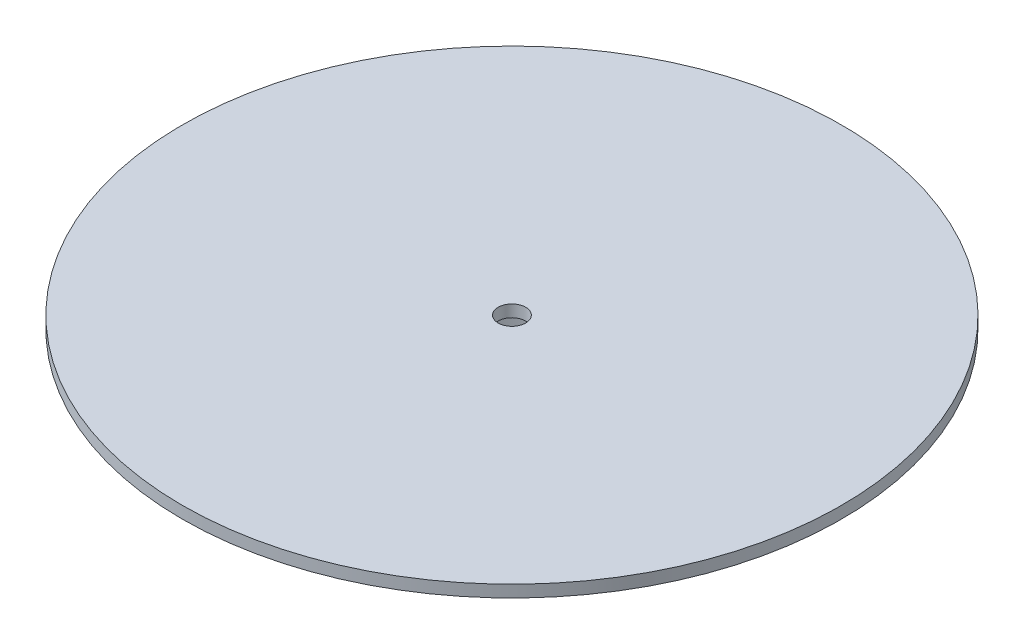
ISO-10303-21;
HEADER;
FILE_DESCRIPTION(('STEP AP214'),'2;1');
FILE_NAME('part.step','',(''),(''),'','','');
FILE_SCHEMA(('AUTOMOTIVE_DESIGN { 1 0 10303 214 1 1 1 1 }'));
ENDSEC;
DATA;
#1=APPLICATION_CONTEXT('core data for automotive mechanical design processes');
#2=APPLICATION_PROTOCOL_DEFINITION('international standard','automotive_design',2000,#1);
#3=PRODUCT_CONTEXT('',#1,'mechanical');
#4=PRODUCT('Part','Part','',(#3));
#5=PRODUCT_RELATED_PRODUCT_CATEGORY('part','',(#4));
#6=PRODUCT_DEFINITION_FORMATION('','',#4);
#7=PRODUCT_DEFINITION_CONTEXT('part definition',#1,'design');
#8=PRODUCT_DEFINITION('design','',#6,#7);
#9=PRODUCT_DEFINITION_SHAPE('','',#8);
#10=(LENGTH_UNIT() NAMED_UNIT(*) SI_UNIT(.MILLI.,.METRE.));
#11=(NAMED_UNIT(*) PLANE_ANGLE_UNIT() SI_UNIT($,.RADIAN.));
#12=(NAMED_UNIT(*) SI_UNIT($,.STERADIAN.) SOLID_ANGLE_UNIT());
#13=UNCERTAINTY_MEASURE_WITH_UNIT(LENGTH_MEASURE(1.E-05),#10,'distance_accuracy_value','');
#14=(GEOMETRIC_REPRESENTATION_CONTEXT(3) GLOBAL_UNCERTAINTY_ASSIGNED_CONTEXT((#13)) GLOBAL_UNIT_ASSIGNED_CONTEXT((#10,
#11,#12)) REPRESENTATION_CONTEXT('',''));
#15=CARTESIAN_POINT('',(0.,0.,0.));
#16=DIRECTION('',(0.,0.,1.));
#17=DIRECTION('',(1.,0.,0.));
#18=AXIS2_PLACEMENT_3D('',#15,#16,#17);
#19=CARTESIAN_POINT('',(0.,2.76606,0.));
#20=DIRECTION('',(0.,-1.,0.));
#21=DIRECTION('',(0.,0.,-1.));
#22=AXIS2_PLACEMENT_3D('',#19,#20,#21);
#23=CYLINDRICAL_SURFACE('',#22,76.2);
#24=CARTESIAN_POINT('',(0.,2.76606,0.));
#25=DIRECTION('',(0.,1.,0.));
#26=DIRECTION('',(0.,0.,1.));
#27=AXIS2_PLACEMENT_3D('',#24,#25,#26);
#28=CIRCLE('',#27,76.2);
#29=CARTESIAN_POINT('',(0.,2.76606,76.2));
#30=VERTEX_POINT('',#29);
#31=EDGE_CURVE('E39',#30,#30,#28,.T.);
#32=ORIENTED_EDGE('',*,*,#31,.F.);
#33=EDGE_LOOP('',(#32));
#34=FACE_BOUND('',#33,.T.);
#35=CARTESIAN_POINT('',(0.,0.,0.));
#36=DIRECTION('',(0.,1.,0.));
#37=DIRECTION('',(0.,0.,1.));
#38=AXIS2_PLACEMENT_3D('',#35,#36,#37);
#39=CIRCLE('',#38,76.2);
#40=CARTESIAN_POINT('',(0.,0.,76.2));
#41=VERTEX_POINT('',#40);
#42=EDGE_CURVE('E43',#41,#41,#39,.T.);
#43=ORIENTED_EDGE('',*,*,#42,.T.);
#44=EDGE_LOOP('',(#43));
#45=FACE_BOUND('',#44,.T.);
#46=ADVANCED_FACE('F33',(#34,#45),#23,.T.);
#47=CARTESIAN_POINT('',(0.,2.76606,0.));
#48=DIRECTION('',(0.,1.,0.));
#49=DIRECTION('',(0.,0.,1.));
#50=AXIS2_PLACEMENT_3D('',#47,#48,#49);
#51=PLANE('',#50);
#52=CARTESIAN_POINT('',(0.,2.76606,0.));
#53=DIRECTION('',(0.,-1.,0.));
#54=DIRECTION('',(0.,0.,-1.));
#55=AXIS2_PLACEMENT_3D('',#52,#53,#54);
#56=CIRCLE('',#55,3.175);
#57=CARTESIAN_POINT('',(0.,2.76606,-3.175));
#58=VERTEX_POINT('',#57);
#59=EDGE_CURVE('E56',#58,#58,#56,.T.);
#60=ORIENTED_EDGE('',*,*,#59,.T.);
#61=EDGE_LOOP('',(#60));
#62=FACE_BOUND('',#61,.T.);
#63=ORIENTED_EDGE('',*,*,#31,.T.);
#64=EDGE_LOOP('',(#63));
#65=FACE_BOUND('',#64,.T.);
#66=ADVANCED_FACE('F65',(#62,#65),#51,.T.);
#67=CARTESIAN_POINT('',(0.,0.,0.));
#68=DIRECTION('',(0.,1.,0.));
#69=DIRECTION('',(0.,0.,1.));
#70=AXIS2_PLACEMENT_3D('',#67,#68,#69);
#71=PLANE('',#70);
#72=CARTESIAN_POINT('',(0.,0.,0.));
#73=DIRECTION('',(0.,1.,0.));
#74=DIRECTION('',(0.,0.,1.));
#75=AXIS2_PLACEMENT_3D('',#72,#73,#74);
#76=CIRCLE('',#75,23.73503);
#77=CARTESIAN_POINT('',(0.,0.,23.73503));
#78=VERTEX_POINT('',#77);
#79=EDGE_CURVE('E10',#78,#78,#76,.F.);
#80=ORIENTED_EDGE('',*,*,#79,.F.);
#81=EDGE_LOOP('',(#80));
#82=FACE_BOUND('',#81,.T.);
#83=ORIENTED_EDGE('',*,*,#42,.F.);
#84=EDGE_LOOP('',(#83));
#85=FACE_BOUND('',#84,.T.);
#86=ADVANCED_FACE('F77',(#82,#85),#71,.F.);
#87=CARTESIAN_POINT('',(0.,-35.56,0.));
#88=DIRECTION('',(0.,-1.,0.));
#89=DIRECTION('',(0.,0.,-1.));
#90=AXIS2_PLACEMENT_3D('',#87,#88,#89);
#91=PLANE('',#90);
#92=CARTESIAN_POINT('',(0.,-35.56,0.));
#93=DIRECTION('',(0.,-1.,0.));
#94=DIRECTION('',(0.,0.,-1.));
#95=AXIS2_PLACEMENT_3D('',#92,#93,#94);
#96=CIRCLE('',#95,23.73503);
#97=CARTESIAN_POINT('',(0.,-35.56,-23.73503));
#98=VERTEX_POINT('',#97);
#99=EDGE_CURVE('E48',#98,#98,#96,.T.);
#100=ORIENTED_EDGE('',*,*,#99,.T.);
#101=EDGE_LOOP('',(#100));
#102=FACE_BOUND('',#101,.T.);
#103=CARTESIAN_POINT('',(0.,-35.56,0.));
#104=DIRECTION('',(0.,-1.,0.));
#105=DIRECTION('',(0.,0.,-1.));
#106=AXIS2_PLACEMENT_3D('',#103,#104,#105);
#107=CIRCLE('',#106,22.352);
#108=CARTESIAN_POINT('',(0.,-35.56,-22.352));
#109=VERTEX_POINT('',#108);
#110=EDGE_CURVE('E52',#109,#109,#107,.T.);
#111=ORIENTED_EDGE('',*,*,#110,.F.);
#112=EDGE_LOOP('',(#111));
#113=FACE_BOUND('',#112,.T.);
#114=ADVANCED_FACE('F87',(#102,#113),#91,.T.);
#115=CARTESIAN_POINT('',(0.,-35.56,0.));
#116=DIRECTION('',(0.,1.,0.));
#117=DIRECTION('',(0.,0.,1.));
#118=AXIS2_PLACEMENT_3D('',#115,#116,#117);
#119=CYLINDRICAL_SURFACE('',#118,23.73503);
#120=ORIENTED_EDGE('',*,*,#99,.F.);
#121=EDGE_LOOP('',(#120));
#122=FACE_BOUND('',#121,.T.);
#123=ORIENTED_EDGE('',*,*,#79,.T.);
#124=EDGE_LOOP('',(#123));
#125=FACE_BOUND('',#124,.T.);
#126=ADVANCED_FACE('F81',(#122,#125),#119,.T.);
#127=CARTESIAN_POINT('',(0.,-35.56,0.));
#128=DIRECTION('',(0.,1.,0.));
#129=DIRECTION('',(0.,0.,1.));
#130=AXIS2_PLACEMENT_3D('',#127,#128,#129);
#131=CYLINDRICAL_SURFACE('',#130,22.352);
#132=ORIENTED_EDGE('',*,*,#110,.T.);
#133=EDGE_LOOP('',(#132));
#134=FACE_BOUND('',#133,.T.);
#135=CARTESIAN_POINT('',(0.,0.,0.));
#136=DIRECTION('',(0.,-1.,0.));
#137=DIRECTION('',(0.,0.,-1.));
#138=AXIS2_PLACEMENT_3D('',#135,#136,#137);
#139=CIRCLE('',#138,22.352);
#140=CARTESIAN_POINT('',(0.,0.,-22.352));
#141=VERTEX_POINT('',#140);
#142=EDGE_CURVE('E53',#141,#141,#139,.T.);
#143=ORIENTED_EDGE('',*,*,#142,.F.);
#144=EDGE_LOOP('',(#143));
#145=FACE_BOUND('',#144,.T.);
#146=ADVANCED_FACE('F76',(#134,#145),#131,.F.);
#147=CARTESIAN_POINT('',(0.,0.,0.));
#148=DIRECTION('',(0.,-1.,0.));
#149=DIRECTION('',(0.,0.,-1.));
#150=AXIS2_PLACEMENT_3D('',#147,#148,#149);
#151=CIRCLE('',#150,3.175);
#152=CARTESIAN_POINT('',(0.,0.,-3.175));
#153=VERTEX_POINT('',#152);
#154=EDGE_CURVE('E59',#153,#153,#151,.T.);
#155=ORIENTED_EDGE('',*,*,#154,.F.);
#156=EDGE_LOOP('',(#155));
#157=FACE_BOUND('',#156,.T.);
#158=ORIENTED_EDGE('',*,*,#142,.T.);
#159=EDGE_LOOP('',(#158));
#160=FACE_BOUND('',#159,.T.);
#161=ADVANCED_FACE('F70',(#157,#160),#71,.F.);
#162=CARTESIAN_POINT('',(0.,2.76606,0.));
#163=DIRECTION('',(0.,-1.,0.));
#164=DIRECTION('',(0.,0.,-1.));
#165=AXIS2_PLACEMENT_3D('',#162,#163,#164);
#166=CYLINDRICAL_SURFACE('',#165,3.175);
#167=ORIENTED_EDGE('',*,*,#59,.F.);
#168=EDGE_LOOP('',(#167));
#169=FACE_BOUND('',#168,.T.);
#170=ORIENTED_EDGE('',*,*,#154,.T.);
#171=EDGE_LOOP('',(#170));
#172=FACE_BOUND('',#171,.T.);
#173=ADVANCED_FACE('F67',(#169,#172),#166,.F.);
#174=CLOSED_SHELL('',(#46,#66,#86,#114,#126,#146,#161,#173));
#175=MANIFOLD_SOLID_BREP('B2',#174);
#176=ADVANCED_BREP_SHAPE_REPRESENTATION('',(#18,#175),#14);
#177=SHAPE_DEFINITION_REPRESENTATION(#9,#176);
ENDSEC;
END-ISO-10303-21;
